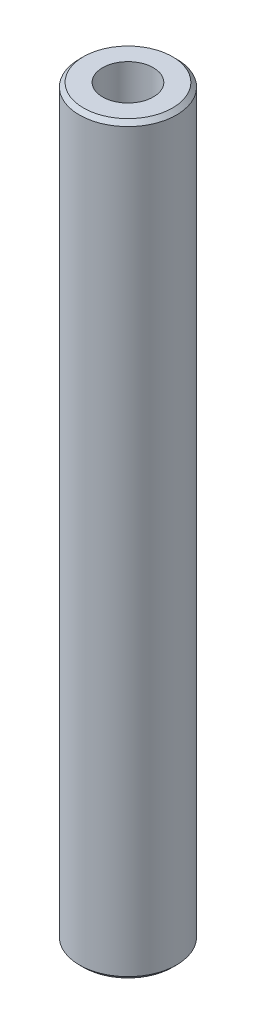
ISO-10303-21;
HEADER;
FILE_DESCRIPTION(('STEP AP214'),'2;1');
FILE_NAME('part.step','',(''),(''),'','','');
FILE_SCHEMA(('AUTOMOTIVE_DESIGN { 1 0 10303 214 1 1 1 1 }'));
ENDSEC;
DATA;
#1=APPLICATION_CONTEXT('core data for automotive mechanical design processes');
#2=APPLICATION_PROTOCOL_DEFINITION('international standard','automotive_design',2000,#1);
#3=PRODUCT_CONTEXT('',#1,'mechanical');
#4=PRODUCT('Part','Part','',(#3));
#5=PRODUCT_RELATED_PRODUCT_CATEGORY('part','',(#4));
#6=PRODUCT_DEFINITION_FORMATION('','',#4);
#7=PRODUCT_DEFINITION_CONTEXT('part definition',#1,'design');
#8=PRODUCT_DEFINITION('design','',#6,#7);
#9=PRODUCT_DEFINITION_SHAPE('','',#8);
#10=(LENGTH_UNIT() NAMED_UNIT(*) SI_UNIT(.MILLI.,.METRE.));
#11=(NAMED_UNIT(*) PLANE_ANGLE_UNIT() SI_UNIT($,.RADIAN.));
#12=(NAMED_UNIT(*) SI_UNIT($,.STERADIAN.) SOLID_ANGLE_UNIT());
#13=UNCERTAINTY_MEASURE_WITH_UNIT(LENGTH_MEASURE(1.E-05),#10,'distance_accuracy_value','');
#14=(GEOMETRIC_REPRESENTATION_CONTEXT(3) GLOBAL_UNCERTAINTY_ASSIGNED_CONTEXT((#13)) GLOBAL_UNIT_ASSIGNED_CONTEXT((#10,
#11,#12)) REPRESENTATION_CONTEXT('',''));
#15=CARTESIAN_POINT('',(0.,0.,0.));
#16=DIRECTION('',(0.,0.,1.));
#17=DIRECTION('',(1.,0.,0.));
#18=AXIS2_PLACEMENT_3D('',#15,#16,#17);
#19=CARTESIAN_POINT('',(0.,36.5125,0.));
#20=DIRECTION('',(0.,-1.,0.));
#21=DIRECTION('',(0.,0.,-1.));
#22=AXIS2_PLACEMENT_3D('',#19,#20,#21);
#23=CYLINDRICAL_SURFACE('',#22,4.7625);
#24=CARTESIAN_POINT('',(0.,-36.115625,0.));
#25=DIRECTION('',(0.,1.,0.));
#26=DIRECTION('',(0.,0.,1.));
#27=AXIS2_PLACEMENT_3D('',#24,#25,#26);
#28=CIRCLE('',#27,4.7625);
#29=CARTESIAN_POINT('',(0.,-36.115625,4.7625));
#30=VERTEX_POINT('',#29);
#31=EDGE_CURVE('E47',#30,#30,#28,.T.);
#32=ORIENTED_EDGE('',*,*,#31,.T.);
#33=EDGE_LOOP('',(#32));
#34=FACE_BOUND('',#33,.T.);
#35=CARTESIAN_POINT('',(0.,36.115625,0.));
#36=DIRECTION('',(0.,1.,0.));
#37=DIRECTION('',(0.,0.,1.));
#38=AXIS2_PLACEMENT_3D('',#35,#36,#37);
#39=CIRCLE('',#38,4.7625);
#40=CARTESIAN_POINT('',(0.,36.115625,4.7625));
#41=VERTEX_POINT('',#40);
#42=EDGE_CURVE('E51',#41,#41,#39,.F.);
#43=ORIENTED_EDGE('',*,*,#42,.T.);
#44=EDGE_LOOP('',(#43));
#45=FACE_BOUND('',#44,.T.);
#46=ADVANCED_FACE('F35',(#34,#45),#23,.T.);
#47=CARTESIAN_POINT('',(0.,36.5125,0.));
#48=DIRECTION('',(0.,1.,0.));
#49=DIRECTION('',(0.,0.,1.));
#50=AXIS2_PLACEMENT_3D('',#47,#48,#49);
#51=PLANE('',#50);
#52=CARTESIAN_POINT('',(0.,36.5125,0.));
#53=DIRECTION('',(0.,1.,0.));
#54=DIRECTION('',(0.,0.,1.));
#55=AXIS2_PLACEMENT_3D('',#52,#53,#54);
#56=CIRCLE('',#55,2.4892);
#57=CARTESIAN_POINT('',(0.,36.5125,2.4892));
#58=VERTEX_POINT('',#57);
#59=EDGE_CURVE('E59',#58,#58,#56,.T.);
#60=ORIENTED_EDGE('',*,*,#59,.F.);
#61=EDGE_LOOP('',(#60));
#62=FACE_BOUND('',#61,.T.);
#63=CARTESIAN_POINT('',(0.,36.5125,0.));
#64=DIRECTION('',(0.,1.,0.));
#65=DIRECTION('',(0.,0.,1.));
#66=AXIS2_PLACEMENT_3D('',#63,#64,#65);
#67=CIRCLE('',#66,4.36562500000001);
#68=CARTESIAN_POINT('',(0.,36.5125,4.36562500000001));
#69=VERTEX_POINT('',#68);
#70=EDGE_CURVE('E10',#69,#69,#67,.T.);
#71=ORIENTED_EDGE('',*,*,#70,.T.);
#72=EDGE_LOOP('',(#71));
#73=FACE_BOUND('',#72,.T.);
#74=ADVANCED_FACE('F65',(#62,#73),#51,.T.);
#75=CARTESIAN_POINT('',(0.,-36.5125,0.));
#76=DIRECTION('',(0.,1.,0.));
#77=DIRECTION('',(0.,0.,1.));
#78=AXIS2_PLACEMENT_3D('',#75,#76,#77);
#79=PLANE('',#78);
#80=CARTESIAN_POINT('',(0.,-36.5125,0.));
#81=DIRECTION('',(0.,1.,0.));
#82=DIRECTION('',(0.,0.,1.));
#83=AXIS2_PLACEMENT_3D('',#80,#81,#82);
#84=CIRCLE('',#83,2.4892);
#85=CARTESIAN_POINT('',(0.,-36.5125,2.4892));
#86=VERTEX_POINT('',#85);
#87=EDGE_CURVE('E56',#86,#86,#84,.T.);
#88=ORIENTED_EDGE('',*,*,#87,.T.);
#89=EDGE_LOOP('',(#88));
#90=FACE_BOUND('',#89,.T.);
#91=CARTESIAN_POINT('',(0.,-36.5125,0.));
#92=DIRECTION('',(0.,1.,0.));
#93=DIRECTION('',(0.,0.,1.));
#94=AXIS2_PLACEMENT_3D('',#91,#92,#93);
#95=CIRCLE('',#94,4.36562499999999);
#96=CARTESIAN_POINT('',(0.,-36.5125,4.36562499999999));
#97=VERTEX_POINT('',#96);
#98=EDGE_CURVE('E43',#97,#97,#95,.F.);
#99=ORIENTED_EDGE('',*,*,#98,.T.);
#100=EDGE_LOOP('',(#99));
#101=FACE_BOUND('',#100,.T.);
#102=ADVANCED_FACE('F67',(#90,#101),#79,.F.);
#103=CARTESIAN_POINT('',(0.,-36.115625,0.));
#104=DIRECTION('',(0.,1.,0.));
#105=DIRECTION('',(0.,0.,1.));
#106=AXIS2_PLACEMENT_3D('',#103,#104,#105);
#107=CONICAL_SURFACE('',#106,4.7625,0.785398163397454);
#108=ORIENTED_EDGE('',*,*,#98,.F.);
#109=EDGE_LOOP('',(#108));
#110=FACE_BOUND('',#109,.T.);
#111=ORIENTED_EDGE('',*,*,#31,.F.);
#112=EDGE_LOOP('',(#111));
#113=FACE_BOUND('',#112,.T.);
#114=ADVANCED_FACE('F73',(#110,#113),#107,.T.);
#115=CARTESIAN_POINT('',(0.,36.5125,0.));
#116=DIRECTION('',(0.,-1.,0.));
#117=DIRECTION('',(0.,0.,-1.));
#118=AXIS2_PLACEMENT_3D('',#115,#116,#117);
#119=CONICAL_SURFACE('',#118,4.36562500000001,0.785398163397454);
#120=ORIENTED_EDGE('',*,*,#42,.F.);
#121=EDGE_LOOP('',(#120));
#122=FACE_BOUND('',#121,.T.);
#123=ORIENTED_EDGE('',*,*,#70,.F.);
#124=EDGE_LOOP('',(#123));
#125=FACE_BOUND('',#124,.T.);
#126=ADVANCED_FACE('F38',(#122,#125),#119,.T.);
#127=CARTESIAN_POINT('',(0.,-36.5125,0.));
#128=DIRECTION('',(0.,1.,0.));
#129=DIRECTION('',(0.,0.,1.));
#130=AXIS2_PLACEMENT_3D('',#127,#128,#129);
#131=CYLINDRICAL_SURFACE('',#130,2.4892);
#132=ORIENTED_EDGE('',*,*,#87,.F.);
#133=EDGE_LOOP('',(#132));
#134=FACE_BOUND('',#133,.T.);
#135=ORIENTED_EDGE('',*,*,#59,.T.);
#136=EDGE_LOOP('',(#135));
#137=FACE_BOUND('',#136,.T.);
#138=ADVANCED_FACE('F63',(#134,#137),#131,.F.);
#139=CLOSED_SHELL('',(#46,#74,#102,#114,#126,#138));
#140=MANIFOLD_SOLID_BREP('B2',#139);
#141=ADVANCED_BREP_SHAPE_REPRESENTATION('',(#18,#140),#14);
#142=SHAPE_DEFINITION_REPRESENTATION(#9,#141);
ENDSEC;
END-ISO-10303-21;
